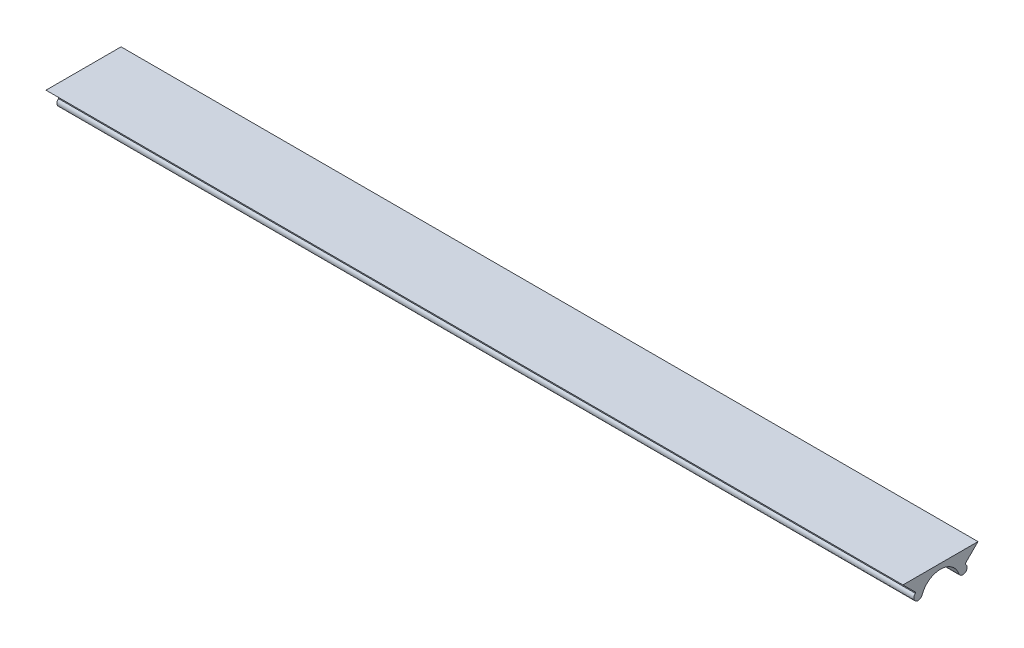
ISO-10303-21;
HEADER;
FILE_DESCRIPTION(('STEP AP214'),'2;1');
FILE_NAME('part.step','',(''),(''),'','','');
FILE_SCHEMA(('AUTOMOTIVE_DESIGN { 1 0 10303 214 1 1 1 1 }'));
ENDSEC;
DATA;
#1=APPLICATION_CONTEXT('core data for automotive mechanical design processes');
#2=APPLICATION_PROTOCOL_DEFINITION('international standard','automotive_design',2000,#1);
#3=PRODUCT_CONTEXT('',#1,'mechanical');
#4=PRODUCT('Part','Part','',(#3));
#5=PRODUCT_RELATED_PRODUCT_CATEGORY('part','',(#4));
#6=PRODUCT_DEFINITION_FORMATION('','',#4);
#7=PRODUCT_DEFINITION_CONTEXT('part definition',#1,'design');
#8=PRODUCT_DEFINITION('design','',#6,#7);
#9=PRODUCT_DEFINITION_SHAPE('','',#8);
#10=(LENGTH_UNIT() NAMED_UNIT(*) SI_UNIT(.MILLI.,.METRE.));
#11=(NAMED_UNIT(*) PLANE_ANGLE_UNIT() SI_UNIT($,.RADIAN.));
#12=(NAMED_UNIT(*) SI_UNIT($,.STERADIAN.) SOLID_ANGLE_UNIT());
#13=UNCERTAINTY_MEASURE_WITH_UNIT(LENGTH_MEASURE(1.E-05),#10,'distance_accuracy_value','');
#14=(GEOMETRIC_REPRESENTATION_CONTEXT(3) GLOBAL_UNCERTAINTY_ASSIGNED_CONTEXT((#13)) GLOBAL_UNIT_ASSIGNED_CONTEXT((#10,
#11,#12)) REPRESENTATION_CONTEXT('',''));
#15=CARTESIAN_POINT('',(0.,0.,0.));
#16=DIRECTION('',(0.,0.,1.));
#17=DIRECTION('',(1.,0.,0.));
#18=AXIS2_PLACEMENT_3D('',#15,#16,#17);
#19=CARTESIAN_POINT('',(132.36428433407,32.6650594637958,7.87586648272482));
#20=DIRECTION('',(-1.,0.,0.));
#21=DIRECTION('',(0.,0.,1.));
#22=AXIS2_PLACEMENT_3D('',#19,#20,#21);
#23=CYLINDRICAL_SURFACE('',#22,2.26195904607473);
#24=CARTESIAN_POINT('',(32.3642843340703,32.6650594637958,7.87586648272482));
#25=DIRECTION('',(1.,0.,0.));
#26=DIRECTION('',(0.,0.,-1.));
#27=AXIS2_PLACEMENT_3D('',#24,#25,#26);
#28=CIRCLE('',#27,2.26195904607473);
#29=CARTESIAN_POINT('',(32.3642843340703,33.4029530978144,10.0140834293872));
#30=VERTEX_POINT('',#29);
#31=CARTESIAN_POINT('',(32.3642843340703,33.4029530978144,5.73764953606247));
#32=VERTEX_POINT('',#31);
#33=EDGE_CURVE('E129',#30,#32,#28,.F.);
#34=ORIENTED_EDGE('',*,*,#33,.T.);
#35=DIRECTION('',(-1.,0.,0.));
#36=VECTOR('',#35,1.);
#37=CARTESIAN_POINT('',(132.36428433407,33.4029530978144,5.73764953606247));
#38=LINE('',#37,#36);
#39=CARTESIAN_POINT('',(132.36428433407,33.4029530978144,5.73764953606247));
#40=VERTEX_POINT('',#39);
#41=EDGE_CURVE('E11',#40,#32,#38,.T.);
#42=ORIENTED_EDGE('',*,*,#41,.F.);
#43=CARTESIAN_POINT('',(132.36428433407,32.6650594637958,7.87586648272482));
#44=DIRECTION('',(1.,0.,0.));
#45=DIRECTION('',(0.,0.,-1.));
#46=AXIS2_PLACEMENT_3D('',#43,#44,#45);
#47=CIRCLE('',#46,2.26195904607473);
#48=CARTESIAN_POINT('',(132.36428433407,33.4029530978144,10.0140834293872));
#49=VERTEX_POINT('',#48);
#50=EDGE_CURVE('E87',#49,#40,#47,.F.);
#51=ORIENTED_EDGE('',*,*,#50,.F.);
#52=DIRECTION('',(-1.,0.,0.));
#53=VECTOR('',#52,1.);
#54=CARTESIAN_POINT('',(132.36428433407,33.4029530978144,10.0140834293872));
#55=LINE('',#54,#53);
#56=EDGE_CURVE('E125',#49,#30,#55,.T.);
#57=ORIENTED_EDGE('',*,*,#56,.T.);
#58=EDGE_LOOP('',(#34,#42,#51,#57));
#59=FACE_BOUND('',#58,.T.);
#60=ADVANCED_FACE('F35',(#59),#23,.F.);
#61=CARTESIAN_POINT('',(132.36428433407,33.566062512925,5.26500239632471));
#62=DIRECTION('',(-1.,0.,0.));
#63=DIRECTION('',(0.,0.,1.));
#64=AXIS2_PLACEMENT_3D('',#61,#62,#63);
#65=CYLINDRICAL_SURFACE('',#64,0.500000000000002);
#66=CARTESIAN_POINT('',(32.3642843340703,33.566062512925,5.26500239632471));
#67=DIRECTION('',(1.,0.,0.));
#68=DIRECTION('',(0.,0.,-1.));
#69=AXIS2_PLACEMENT_3D('',#66,#67,#68);
#70=CIRCLE('',#69,0.500000000000002);
#71=CARTESIAN_POINT('',(32.3642843340703,33.9550594637958,4.95086648272482));
#72=VERTEX_POINT('',#71);
#73=EDGE_CURVE('E132',#72,#32,#70,.F.);
#74=ORIENTED_EDGE('',*,*,#73,.F.);
#75=DIRECTION('',(-1.,0.,0.));
#76=VECTOR('',#75,1.);
#77=CARTESIAN_POINT('',(132.36428433407,33.9550594637958,4.95086648272482));
#78=LINE('',#77,#76);
#79=CARTESIAN_POINT('',(132.36428433407,33.9550594637958,4.95086648272482));
#80=VERTEX_POINT('',#79);
#81=EDGE_CURVE('E43',#80,#72,#78,.T.);
#82=ORIENTED_EDGE('',*,*,#81,.F.);
#83=CARTESIAN_POINT('',(132.36428433407,33.566062512925,5.26500239632471));
#84=DIRECTION('',(1.,0.,0.));
#85=DIRECTION('',(0.,0.,-1.));
#86=AXIS2_PLACEMENT_3D('',#83,#84,#85);
#87=CIRCLE('',#86,0.500000000000002);
#88=EDGE_CURVE('E173',#80,#40,#87,.F.);
#89=ORIENTED_EDGE('',*,*,#88,.T.);
#90=ORIENTED_EDGE('',*,*,#41,.T.);
#91=EDGE_LOOP('',(#74,#82,#89,#90));
#92=FACE_BOUND('',#91,.T.);
#93=ADVANCED_FACE('F163',(#92),#65,.T.);
#94=CARTESIAN_POINT('',(132.36428433407,0.,4.95086648272506));
#95=DIRECTION('',(0.,0.,-1.));
#96=DIRECTION('',(0.,1.,0.));
#97=AXIS2_PLACEMENT_3D('',#94,#95,#96);
#98=PLANE('',#97);
#99=DIRECTION('',(0.,-1.,0.));
#100=VECTOR('',#99,1.);
#101=CARTESIAN_POINT('',(32.3642843340703,0.,4.95086648272506));
#102=LINE('',#101,#100);
#103=CARTESIAN_POINT('',(32.3642843340703,34.0792015994195,4.95086648272482));
#104=VERTEX_POINT('',#103);
#105=EDGE_CURVE('E135',#104,#72,#102,.T.);
#106=ORIENTED_EDGE('',*,*,#105,.F.);
#107=DIRECTION('',(-1.,0.,0.));
#108=VECTOR('',#107,1.);
#109=CARTESIAN_POINT('',(132.36428433407,34.0792015994195,4.95086648272482));
#110=LINE('',#109,#108);
#111=CARTESIAN_POINT('',(132.36428433407,34.0792015994195,4.95086648272482));
#112=VERTEX_POINT('',#111);
#113=EDGE_CURVE('E153',#112,#104,#110,.T.);
#114=ORIENTED_EDGE('',*,*,#113,.F.);
#115=DIRECTION('',(0.,-1.,0.));
#116=VECTOR('',#115,1.);
#117=CARTESIAN_POINT('',(132.36428433407,0.,4.95086648272506));
#118=LINE('',#117,#116);
#119=EDGE_CURVE('E160',#112,#80,#118,.T.);
#120=ORIENTED_EDGE('',*,*,#119,.T.);
#121=ORIENTED_EDGE('',*,*,#81,.T.);
#122=EDGE_LOOP('',(#106,#114,#120,#121));
#123=FACE_BOUND('',#122,.T.);
#124=ADVANCED_FACE('F158',(#123),#98,.T.);
#125=CARTESIAN_POINT('',(132.36428433407,19.5150340410722,19.5150340410721));
#126=DIRECTION('',(0.,-0.707106781186549,-0.707106781186546));
#127=DIRECTION('',(0.,0.707106781186546,-0.707106781186549));
#128=AXIS2_PLACEMENT_3D('',#125,#126,#127);
#129=PLANE('',#128);
#130=DIRECTION('',(0.,-0.707106781186546,0.707106781186549));
#131=VECTOR('',#130,1.);
#132=CARTESIAN_POINT('',(32.3642843340703,19.5150340410722,19.5150340410721));
#133=LINE('',#132,#131);
#134=CARTESIAN_POINT('',(32.3642843340703,35.5336738209331,3.49639426121118));
#135=VERTEX_POINT('',#134);
#136=EDGE_CURVE('E138',#135,#104,#133,.T.);
#137=ORIENTED_EDGE('',*,*,#136,.F.);
#138=DIRECTION('',(-1.,0.,0.));
#139=VECTOR('',#138,1.);
#140=CARTESIAN_POINT('',(132.36428433407,35.5336738209331,3.49639426121118));
#141=LINE('',#140,#139);
#142=CARTESIAN_POINT('',(132.36428433407,35.5336738209331,3.49639426121118));
#143=VERTEX_POINT('',#142);
#144=EDGE_CURVE('E151',#143,#135,#141,.T.);
#145=ORIENTED_EDGE('',*,*,#144,.F.);
#146=DIRECTION('',(0.,-0.707106781186546,0.707106781186549));
#147=VECTOR('',#146,1.);
#148=CARTESIAN_POINT('',(132.36428433407,19.5150340410722,19.5150340410721));
#149=LINE('',#148,#147);
#150=EDGE_CURVE('E172',#143,#112,#149,.T.);
#151=ORIENTED_EDGE('',*,*,#150,.T.);
#152=ORIENTED_EDGE('',*,*,#113,.T.);
#153=EDGE_LOOP('',(#137,#145,#151,#152));
#154=FACE_BOUND('',#153,.T.);
#155=ADVANCED_FACE('F170',(#154),#129,.T.);
#156=CARTESIAN_POINT('',(132.36428433407,35.5336738209331,0.));
#157=DIRECTION('',(0.,1.,0.));
#158=DIRECTION('',(0.,0.,1.));
#159=AXIS2_PLACEMENT_3D('',#156,#157,#158);
#160=PLANE('',#159);
#161=DIRECTION('',(0.,0.,-1.));
#162=VECTOR('',#161,1.);
#163=CARTESIAN_POINT('',(32.3642843340703,35.5336738209331,0.));
#164=LINE('',#163,#162);
#165=CARTESIAN_POINT('',(32.3642843340703,35.5336738209331,12.2553387042384));
#166=VERTEX_POINT('',#165);
#167=EDGE_CURVE('E141',#166,#135,#164,.T.);
#168=ORIENTED_EDGE('',*,*,#167,.F.);
#169=DIRECTION('',(-1.,0.,0.));
#170=VECTOR('',#169,1.);
#171=CARTESIAN_POINT('',(132.36428433407,35.5336738209331,12.2553387042384));
#172=LINE('',#171,#170);
#173=CARTESIAN_POINT('',(132.36428433407,35.5336738209331,12.2553387042384));
#174=VERTEX_POINT('',#173);
#175=EDGE_CURVE('E114',#174,#166,#172,.T.);
#176=ORIENTED_EDGE('',*,*,#175,.F.);
#177=DIRECTION('',(0.,0.,-1.));
#178=VECTOR('',#177,1.);
#179=CARTESIAN_POINT('',(132.36428433407,35.5336738209331,0.));
#180=LINE('',#179,#178);
#181=EDGE_CURVE('E121',#174,#143,#180,.T.);
#182=ORIENTED_EDGE('',*,*,#181,.T.);
#183=ORIENTED_EDGE('',*,*,#144,.T.);
#184=EDGE_LOOP('',(#168,#176,#182,#183));
#185=FACE_BOUND('',#184,.T.);
#186=ADVANCED_FACE('F179',(#185),#160,.T.);
#187=CARTESIAN_POINT('',(132.36428433407,11.6391675583473,-11.6391675583473));
#188=DIRECTION('',(0.,-0.707106781186547,0.707106781186548));
#189=DIRECTION('',(0.,-0.707106781186548,-0.707106781186547));
#190=AXIS2_PLACEMENT_3D('',#187,#188,#189);
#191=PLANE('',#190);
#192=DIRECTION('',(0.,0.707106781186548,0.707106781186547));
#193=VECTOR('',#192,1.);
#194=CARTESIAN_POINT('',(32.3642843340703,11.6391675583473,-11.6391675583473));
#195=LINE('',#194,#193);
#196=CARTESIAN_POINT('',(32.3642843340703,34.0792015994195,10.8008664827248));
#197=VERTEX_POINT('',#196);
#198=EDGE_CURVE('E109',#197,#166,#195,.T.);
#199=ORIENTED_EDGE('',*,*,#198,.F.);
#200=DIRECTION('',(-1.,0.,0.));
#201=VECTOR('',#200,1.);
#202=CARTESIAN_POINT('',(132.36428433407,34.0792015994195,10.8008664827248));
#203=LINE('',#202,#201);
#204=CARTESIAN_POINT('',(132.36428433407,34.0792015994195,10.8008664827248));
#205=VERTEX_POINT('',#204);
#206=EDGE_CURVE('E104',#205,#197,#203,.T.);
#207=ORIENTED_EDGE('',*,*,#206,.F.);
#208=DIRECTION('',(0.,0.707106781186548,0.707106781186547));
#209=VECTOR('',#208,1.);
#210=CARTESIAN_POINT('',(132.36428433407,11.6391675583473,-11.6391675583473));
#211=LINE('',#210,#209);
#212=EDGE_CURVE('E107',#205,#174,#211,.T.);
#213=ORIENTED_EDGE('',*,*,#212,.T.);
#214=ORIENTED_EDGE('',*,*,#175,.T.);
#215=EDGE_LOOP('',(#199,#207,#213,#214));
#216=FACE_BOUND('',#215,.T.);
#217=ADVANCED_FACE('F106',(#216),#191,.T.);
#218=CARTESIAN_POINT('',(132.36428433407,0.,10.8008664827248));
#219=DIRECTION('',(0.,0.,1.));
#220=DIRECTION('',(1.,0.,0.));
#221=AXIS2_PLACEMENT_3D('',#218,#219,#220);
#222=PLANE('',#221);
#223=DIRECTION('',(0.,1.,0.));
#224=VECTOR('',#223,1.);
#225=CARTESIAN_POINT('',(32.3642843340703,0.,10.8008664827248));
#226=LINE('',#225,#224);
#227=CARTESIAN_POINT('',(32.3642843340703,33.9550594637958,10.8008664827248));
#228=VERTEX_POINT('',#227);
#229=EDGE_CURVE('E145',#228,#197,#226,.T.);
#230=ORIENTED_EDGE('',*,*,#229,.F.);
#231=DIRECTION('',(-1.,0.,0.));
#232=VECTOR('',#231,1.);
#233=CARTESIAN_POINT('',(132.36428433407,33.9550594637958,10.8008664827248));
#234=LINE('',#233,#232);
#235=CARTESIAN_POINT('',(132.36428433407,33.9550594637958,10.8008664827248));
#236=VERTEX_POINT('',#235);
#237=EDGE_CURVE('E78',#236,#228,#234,.T.);
#238=ORIENTED_EDGE('',*,*,#237,.F.);
#239=DIRECTION('',(0.,1.,0.));
#240=VECTOR('',#239,1.);
#241=CARTESIAN_POINT('',(132.36428433407,0.,10.8008664827248));
#242=LINE('',#241,#240);
#243=EDGE_CURVE('E118',#236,#205,#242,.T.);
#244=ORIENTED_EDGE('',*,*,#243,.T.);
#245=ORIENTED_EDGE('',*,*,#206,.T.);
#246=EDGE_LOOP('',(#230,#238,#244,#245));
#247=FACE_BOUND('',#246,.T.);
#248=ADVANCED_FACE('F123',(#247),#222,.T.);
#249=CARTESIAN_POINT('',(132.36428433407,33.566062512925,10.4867305691249));
#250=DIRECTION('',(-1.,0.,0.));
#251=DIRECTION('',(0.,0.,1.));
#252=AXIS2_PLACEMENT_3D('',#249,#250,#251);
#253=CYLINDRICAL_SURFACE('',#252,0.500000000000001);
#254=CARTESIAN_POINT('',(32.3642843340703,33.566062512925,10.4867305691249));
#255=DIRECTION('',(1.,0.,0.));
#256=DIRECTION('',(0.,0.,-1.));
#257=AXIS2_PLACEMENT_3D('',#254,#255,#256);
#258=CIRCLE('',#257,0.500000000000001);
#259=EDGE_CURVE('E81',#228,#30,#258,.T.);
#260=ORIENTED_EDGE('',*,*,#259,.T.);
#261=ORIENTED_EDGE('',*,*,#56,.F.);
#262=CARTESIAN_POINT('',(132.36428433407,33.566062512925,10.4867305691249));
#263=DIRECTION('',(1.,0.,0.));
#264=DIRECTION('',(0.,0.,-1.));
#265=AXIS2_PLACEMENT_3D('',#262,#263,#264);
#266=CIRCLE('',#265,0.500000000000001);
#267=EDGE_CURVE('E51',#236,#49,#266,.T.);
#268=ORIENTED_EDGE('',*,*,#267,.F.);
#269=ORIENTED_EDGE('',*,*,#237,.T.);
#270=EDGE_LOOP('',(#260,#261,#268,#269));
#271=FACE_BOUND('',#270,.T.);
#272=ADVANCED_FACE('F181',(#271),#253,.T.);
#273=CARTESIAN_POINT('',(132.36428433407,0.,0.));
#274=DIRECTION('',(1.,0.,0.));
#275=DIRECTION('',(0.,0.,-1.));
#276=AXIS2_PLACEMENT_3D('',#273,#274,#275);
#277=PLANE('',#276);
#278=ORIENTED_EDGE('',*,*,#50,.T.);
#279=ORIENTED_EDGE('',*,*,#88,.F.);
#280=ORIENTED_EDGE('',*,*,#119,.F.);
#281=ORIENTED_EDGE('',*,*,#150,.F.);
#282=ORIENTED_EDGE('',*,*,#181,.F.);
#283=ORIENTED_EDGE('',*,*,#212,.F.);
#284=ORIENTED_EDGE('',*,*,#243,.F.);
#285=ORIENTED_EDGE('',*,*,#267,.T.);
#286=EDGE_LOOP('',(#278,#279,#280,#281,#282,#283,#284,#285));
#287=FACE_BOUND('',#286,.T.);
#288=ADVANCED_FACE('F117',(#287),#277,.T.);
#289=CARTESIAN_POINT('',(32.3642843340703,0.,0.));
#290=DIRECTION('',(1.,0.,0.));
#291=DIRECTION('',(0.,0.,-1.));
#292=AXIS2_PLACEMENT_3D('',#289,#290,#291);
#293=PLANE('',#292);
#294=ORIENTED_EDGE('',*,*,#33,.F.);
#295=ORIENTED_EDGE('',*,*,#259,.F.);
#296=ORIENTED_EDGE('',*,*,#229,.T.);
#297=ORIENTED_EDGE('',*,*,#198,.T.);
#298=ORIENTED_EDGE('',*,*,#167,.T.);
#299=ORIENTED_EDGE('',*,*,#136,.T.);
#300=ORIENTED_EDGE('',*,*,#105,.T.);
#301=ORIENTED_EDGE('',*,*,#73,.T.);
#302=EDGE_LOOP('',(#294,#295,#296,#297,#298,#299,#300,#301));
#303=FACE_BOUND('',#302,.T.);
#304=ADVANCED_FACE('F166',(#303),#293,.F.);
#305=CLOSED_SHELL('',(#60,#93,#124,#155,#186,#217,#248,#272,#288,#304));
#306=MANIFOLD_SOLID_BREP('B2',#305);
#307=ADVANCED_BREP_SHAPE_REPRESENTATION('',(#18,#306),#14);
#308=SHAPE_DEFINITION_REPRESENTATION(#9,#307);
ENDSEC;
END-ISO-10303-21;
